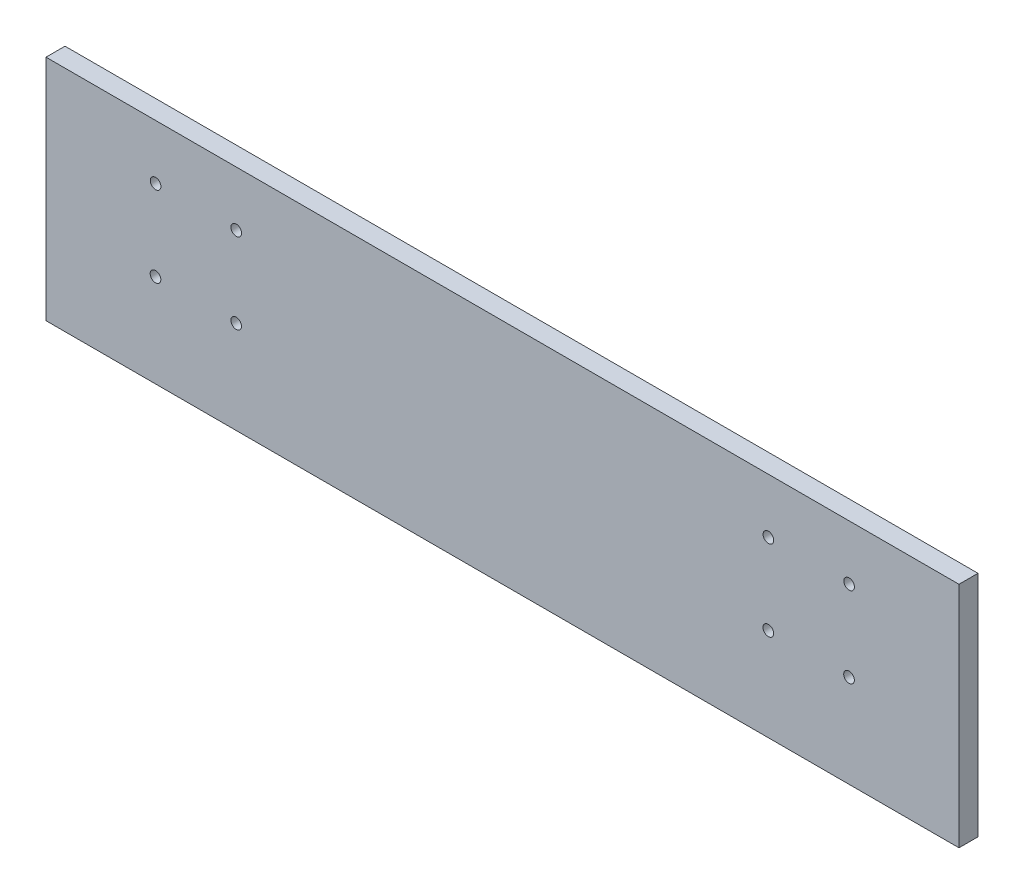
ISO-10303-21;
HEADER;
FILE_DESCRIPTION(('STEP AP214'),'2;1');
FILE_NAME('part.step','',(''),(''),'','','');
FILE_SCHEMA(('AUTOMOTIVE_DESIGN { 1 0 10303 214 1 1 1 1 }'));
ENDSEC;
DATA;
#1=APPLICATION_CONTEXT('core data for automotive mechanical design processes');
#2=APPLICATION_PROTOCOL_DEFINITION('international standard','automotive_design',2000,#1);
#3=PRODUCT_CONTEXT('',#1,'mechanical');
#4=PRODUCT('Part','Part','',(#3));
#5=PRODUCT_RELATED_PRODUCT_CATEGORY('part','',(#4));
#6=PRODUCT_DEFINITION_FORMATION('','',#4);
#7=PRODUCT_DEFINITION_CONTEXT('part definition',#1,'design');
#8=PRODUCT_DEFINITION('design','',#6,#7);
#9=PRODUCT_DEFINITION_SHAPE('','',#8);
#10=(LENGTH_UNIT() NAMED_UNIT(*) SI_UNIT(.MILLI.,.METRE.));
#11=(NAMED_UNIT(*) PLANE_ANGLE_UNIT() SI_UNIT($,.RADIAN.));
#12=(NAMED_UNIT(*) SI_UNIT($,.STERADIAN.) SOLID_ANGLE_UNIT());
#13=UNCERTAINTY_MEASURE_WITH_UNIT(LENGTH_MEASURE(1.E-05),#10,'distance_accuracy_value','');
#14=(GEOMETRIC_REPRESENTATION_CONTEXT(3) GLOBAL_UNCERTAINTY_ASSIGNED_CONTEXT((#13)) GLOBAL_UNIT_ASSIGNED_CONTEXT((#10,
#11,#12)) REPRESENTATION_CONTEXT('',''));
#15=CARTESIAN_POINT('',(0.,0.,0.));
#16=DIRECTION('',(0.,0.,1.));
#17=DIRECTION('',(1.,0.,0.));
#18=AXIS2_PLACEMENT_3D('',#15,#16,#17);
#19=CARTESIAN_POINT('',(0.,0.,6.35));
#20=DIRECTION('',(1.,0.,0.));
#21=DIRECTION('',(0.,0.,-1.));
#22=AXIS2_PLACEMENT_3D('',#19,#20,#21);
#23=PLANE('',#22);
#24=DIRECTION('',(0.,-1.,0.));
#25=VECTOR('',#24,1.);
#26=CARTESIAN_POINT('',(0.,0.,0.));
#27=LINE('',#26,#25);
#28=CARTESIAN_POINT('',(0.,76.2,0.));
#29=VERTEX_POINT('',#28);
#30=CARTESIAN_POINT('',(0.,0.,0.));
#31=VERTEX_POINT('',#30);
#32=EDGE_CURVE('E96',#29,#31,#27,.T.);
#33=ORIENTED_EDGE('',*,*,#32,.T.);
#34=DIRECTION('',(0.,0.,-1.));
#35=VECTOR('',#34,1.);
#36=CARTESIAN_POINT('',(0.,0.,6.35));
#37=LINE('',#36,#35);
#38=CARTESIAN_POINT('',(0.,0.,6.35));
#39=VERTEX_POINT('',#38);
#40=EDGE_CURVE('E11',#39,#31,#37,.T.);
#41=ORIENTED_EDGE('',*,*,#40,.F.);
#42=DIRECTION('',(0.,-1.,0.));
#43=VECTOR('',#42,1.);
#44=CARTESIAN_POINT('',(0.,0.,6.35));
#45=LINE('',#44,#43);
#46=CARTESIAN_POINT('',(0.,76.2,6.35));
#47=VERTEX_POINT('',#46);
#48=EDGE_CURVE('E84',#47,#39,#45,.T.);
#49=ORIENTED_EDGE('',*,*,#48,.F.);
#50=DIRECTION('',(0.,0.,-1.));
#51=VECTOR('',#50,1.);
#52=CARTESIAN_POINT('',(0.,76.2,6.35));
#53=LINE('',#52,#51);
#54=EDGE_CURVE('E92',#47,#29,#53,.T.);
#55=ORIENTED_EDGE('',*,*,#54,.T.);
#56=EDGE_LOOP('',(#33,#41,#49,#55));
#57=FACE_BOUND('',#56,.T.);
#58=ADVANCED_FACE('F33',(#57),#23,.F.);
#59=CARTESIAN_POINT('',(0.,0.,6.35));
#60=DIRECTION('',(0.,1.,0.));
#61=DIRECTION('',(0.,0.,1.));
#62=AXIS2_PLACEMENT_3D('',#59,#60,#61);
#63=PLANE('',#62);
#64=DIRECTION('',(1.,0.,0.));
#65=VECTOR('',#64,1.);
#66=CARTESIAN_POINT('',(0.,0.,0.));
#67=LINE('',#66,#65);
#68=CARTESIAN_POINT('',(304.8,0.,0.));
#69=VERTEX_POINT('',#68);
#70=EDGE_CURVE('E88',#31,#69,#67,.T.);
#71=ORIENTED_EDGE('',*,*,#70,.T.);
#72=DIRECTION('',(0.,0.,-1.));
#73=VECTOR('',#72,1.);
#74=CARTESIAN_POINT('',(304.8,0.,6.35));
#75=LINE('',#74,#73);
#76=CARTESIAN_POINT('',(304.8,0.,6.35));
#77=VERTEX_POINT('',#76);
#78=EDGE_CURVE('E41',#77,#69,#75,.T.);
#79=ORIENTED_EDGE('',*,*,#78,.F.);
#80=DIRECTION('',(1.,0.,0.));
#81=VECTOR('',#80,1.);
#82=CARTESIAN_POINT('',(0.,0.,6.35));
#83=LINE('',#82,#81);
#84=EDGE_CURVE('E79',#39,#77,#83,.T.);
#85=ORIENTED_EDGE('',*,*,#84,.F.);
#86=ORIENTED_EDGE('',*,*,#40,.T.);
#87=EDGE_LOOP('',(#71,#79,#85,#86));
#88=FACE_BOUND('',#87,.T.);
#89=ADVANCED_FACE('F87',(#88),#63,.F.);
#90=CARTESIAN_POINT('',(304.8,0.,6.35));
#91=DIRECTION('',(-1.,0.,0.));
#92=DIRECTION('',(0.,0.,1.));
#93=AXIS2_PLACEMENT_3D('',#90,#91,#92);
#94=PLANE('',#93);
#95=DIRECTION('',(0.,1.,0.));
#96=VECTOR('',#95,1.);
#97=CARTESIAN_POINT('',(304.8,0.,0.));
#98=LINE('',#97,#96);
#99=CARTESIAN_POINT('',(304.8,76.2,0.));
#100=VERTEX_POINT('',#99);
#101=EDGE_CURVE('E66',#69,#100,#98,.T.);
#102=ORIENTED_EDGE('',*,*,#101,.T.);
#103=DIRECTION('',(0.,0.,-1.));
#104=VECTOR('',#103,1.);
#105=CARTESIAN_POINT('',(304.8,76.2,6.35));
#106=LINE('',#105,#104);
#107=CARTESIAN_POINT('',(304.8,76.2,6.35));
#108=VERTEX_POINT('',#107);
#109=EDGE_CURVE('E89',#108,#100,#106,.T.);
#110=ORIENTED_EDGE('',*,*,#109,.F.);
#111=DIRECTION('',(0.,1.,0.));
#112=VECTOR('',#111,1.);
#113=CARTESIAN_POINT('',(304.8,0.,6.35));
#114=LINE('',#113,#112);
#115=EDGE_CURVE('E82',#77,#108,#114,.T.);
#116=ORIENTED_EDGE('',*,*,#115,.F.);
#117=ORIENTED_EDGE('',*,*,#78,.T.);
#118=EDGE_LOOP('',(#102,#110,#116,#117));
#119=FACE_BOUND('',#118,.T.);
#120=ADVANCED_FACE('F90',(#119),#94,.F.);
#121=CARTESIAN_POINT('',(0.,76.2,6.35));
#122=DIRECTION('',(0.,-1.,0.));
#123=DIRECTION('',(0.,0.,-1.));
#124=AXIS2_PLACEMENT_3D('',#121,#122,#123);
#125=PLANE('',#124);
#126=DIRECTION('',(-1.,0.,0.));
#127=VECTOR('',#126,1.);
#128=CARTESIAN_POINT('',(0.,76.2,0.));
#129=LINE('',#128,#127);
#130=EDGE_CURVE('E72',#100,#29,#129,.T.);
#131=ORIENTED_EDGE('',*,*,#130,.T.);
#132=ORIENTED_EDGE('',*,*,#54,.F.);
#133=DIRECTION('',(-1.,0.,0.));
#134=VECTOR('',#133,1.);
#135=CARTESIAN_POINT('',(0.,76.2,6.35));
#136=LINE('',#135,#134);
#137=EDGE_CURVE('E49',#108,#47,#136,.T.);
#138=ORIENTED_EDGE('',*,*,#137,.F.);
#139=ORIENTED_EDGE('',*,*,#109,.T.);
#140=EDGE_LOOP('',(#131,#132,#138,#139));
#141=FACE_BOUND('',#140,.T.);
#142=ADVANCED_FACE('F104',(#141),#125,.F.);
#143=CARTESIAN_POINT('',(0.,0.,6.35));
#144=DIRECTION('',(0.,0.,-1.));
#145=DIRECTION('',(-1.,0.,0.));
#146=AXIS2_PLACEMENT_3D('',#143,#144,#145);
#147=PLANE('',#146);
#148=CARTESIAN_POINT('',(36.5563858249365,31.0187951818948,6.35));
#149=DIRECTION('',(0.,0.,-1.));
#150=DIRECTION('',(-1.,0.,0.));
#151=AXIS2_PLACEMENT_3D('',#148,#149,#150);
#152=CIRCLE('',#151,1.77799999999999);
#153=CARTESIAN_POINT('',(34.7783858249365,31.0187951818948,6.35));
#154=VERTEX_POINT('',#153);
#155=EDGE_CURVE('E151',#154,#154,#152,.T.);
#156=ORIENTED_EDGE('',*,*,#155,.T.);
#157=EDGE_LOOP('',(#156));
#158=FACE_BOUND('',#157,.T.);
#159=CARTESIAN_POINT('',(63.4971448181051,30.9963258249363,6.35));
#160=DIRECTION('',(0.,0.,-1.));
#161=DIRECTION('',(-1.,0.,0.));
#162=AXIS2_PLACEMENT_3D('',#159,#160,#161);
#163=CIRCLE('',#162,1.778);
#164=CARTESIAN_POINT('',(61.7191448181051,30.9963258249363,6.35));
#165=VERTEX_POINT('',#164);
#166=EDGE_CURVE('E145',#165,#165,#163,.T.);
#167=ORIENTED_EDGE('',*,*,#166,.T.);
#168=EDGE_LOOP('',(#167));
#169=FACE_BOUND('',#168,.T.);
#170=CARTESIAN_POINT('',(63.5196141750636,57.937084818105,6.35));
#171=DIRECTION('',(0.,0.,-1.));
#172=DIRECTION('',(-1.,0.,0.));
#173=AXIS2_PLACEMENT_3D('',#170,#171,#172);
#174=CIRCLE('',#173,1.77799999999998);
#175=CARTESIAN_POINT('',(61.7416141750636,57.937084818105,6.35));
#176=VERTEX_POINT('',#175);
#177=EDGE_CURVE('E139',#176,#176,#174,.T.);
#178=ORIENTED_EDGE('',*,*,#177,.T.);
#179=EDGE_LOOP('',(#178));
#180=FACE_BOUND('',#179,.T.);
#181=CARTESIAN_POINT('',(36.5788551818951,57.9595541750636,6.35));
#182=DIRECTION('',(0.,0.,-1.));
#183=DIRECTION('',(-1.,0.,0.));
#184=AXIS2_PLACEMENT_3D('',#181,#182,#183);
#185=CIRCLE('',#184,1.77799999999999);
#186=CARTESIAN_POINT('',(34.8008551818951,57.9595541750636,6.35));
#187=VERTEX_POINT('',#186);
#188=EDGE_CURVE('E133',#187,#187,#185,.T.);
#189=ORIENTED_EDGE('',*,*,#188,.T.);
#190=EDGE_LOOP('',(#189));
#191=FACE_BOUND('',#190,.T.);
#192=CARTESIAN_POINT('',(268.094144818105,30.9963258249363,6.35));
#193=DIRECTION('',(0.,0.,-1.));
#194=DIRECTION('',(-1.,0.,0.));
#195=AXIS2_PLACEMENT_3D('',#192,#193,#194);
#196=CIRCLE('',#195,1.77800000000004);
#197=CARTESIAN_POINT('',(266.316144818105,30.9963258249363,6.35));
#198=VERTEX_POINT('',#197);
#199=EDGE_CURVE('E127',#198,#198,#196,.T.);
#200=ORIENTED_EDGE('',*,*,#199,.T.);
#201=EDGE_LOOP('',(#200));
#202=FACE_BOUND('',#201,.T.);
#203=CARTESIAN_POINT('',(241.153385824936,31.0187951818948,6.35));
#204=DIRECTION('',(0.,0.,-1.));
#205=DIRECTION('',(-1.,0.,0.));
#206=AXIS2_PLACEMENT_3D('',#203,#204,#205);
#207=CIRCLE('',#206,1.77800000000001);
#208=CARTESIAN_POINT('',(239.375385824936,31.0187951818948,6.35));
#209=VERTEX_POINT('',#208);
#210=EDGE_CURVE('E121',#209,#209,#207,.T.);
#211=ORIENTED_EDGE('',*,*,#210,.T.);
#212=EDGE_LOOP('',(#211));
#213=FACE_BOUND('',#212,.T.);
#214=CARTESIAN_POINT('',(241.175855181895,57.9595541750636,6.35));
#215=DIRECTION('',(0.,0.,-1.));
#216=DIRECTION('',(-1.,0.,0.));
#217=AXIS2_PLACEMENT_3D('',#214,#215,#216);
#218=CIRCLE('',#217,1.77800000000001);
#219=CARTESIAN_POINT('',(239.397855181895,57.9595541750636,6.35));
#220=VERTEX_POINT('',#219);
#221=EDGE_CURVE('E115',#220,#220,#218,.T.);
#222=ORIENTED_EDGE('',*,*,#221,.T.);
#223=EDGE_LOOP('',(#222));
#224=FACE_BOUND('',#223,.T.);
#225=CARTESIAN_POINT('',(268.116614175063,57.937084818105,6.35));
#226=DIRECTION('',(0.,0.,-1.));
#227=DIRECTION('',(-1.,0.,0.));
#228=AXIS2_PLACEMENT_3D('',#225,#226,#227);
#229=CIRCLE('',#228,1.77799999999998);
#230=CARTESIAN_POINT('',(266.338614175063,57.937084818105,6.35));
#231=VERTEX_POINT('',#230);
#232=EDGE_CURVE('E99',#231,#231,#229,.T.);
#233=ORIENTED_EDGE('',*,*,#232,.T.);
#234=EDGE_LOOP('',(#233));
#235=FACE_BOUND('',#234,.T.);
#236=ORIENTED_EDGE('',*,*,#48,.T.);
#237=ORIENTED_EDGE('',*,*,#84,.T.);
#238=ORIENTED_EDGE('',*,*,#115,.T.);
#239=ORIENTED_EDGE('',*,*,#137,.T.);
#240=EDGE_LOOP('',(#236,#237,#238,#239));
#241=FACE_BOUND('',#240,.T.);
#242=ADVANCED_FACE('F80',(#158,#169,#180,#191,#202,#213,#224,#235,#241),#147,.F.);
#243=CARTESIAN_POINT('',(0.,0.,0.));
#244=DIRECTION('',(0.,0.,-1.));
#245=DIRECTION('',(-1.,0.,0.));
#246=AXIS2_PLACEMENT_3D('',#243,#244,#245);
#247=PLANE('',#246);
#248=CARTESIAN_POINT('',(36.5563858249365,31.0187951818948,0.));
#249=DIRECTION('',(0.,0.,-1.));
#250=DIRECTION('',(-1.,0.,0.));
#251=AXIS2_PLACEMENT_3D('',#248,#249,#250);
#252=CIRCLE('',#251,1.77799999999999);
#253=CARTESIAN_POINT('',(34.7783858249365,31.0187951818948,0.));
#254=VERTEX_POINT('',#253);
#255=EDGE_CURVE('E154',#254,#254,#252,.T.);
#256=ORIENTED_EDGE('',*,*,#255,.F.);
#257=EDGE_LOOP('',(#256));
#258=FACE_BOUND('',#257,.T.);
#259=CARTESIAN_POINT('',(63.4971448181051,30.9963258249363,0.));
#260=DIRECTION('',(0.,0.,-1.));
#261=DIRECTION('',(-1.,0.,0.));
#262=AXIS2_PLACEMENT_3D('',#259,#260,#261);
#263=CIRCLE('',#262,1.778);
#264=CARTESIAN_POINT('',(61.7191448181051,30.9963258249363,0.));
#265=VERTEX_POINT('',#264);
#266=EDGE_CURVE('E148',#265,#265,#263,.T.);
#267=ORIENTED_EDGE('',*,*,#266,.F.);
#268=EDGE_LOOP('',(#267));
#269=FACE_BOUND('',#268,.T.);
#270=CARTESIAN_POINT('',(63.5196141750636,57.937084818105,0.));
#271=DIRECTION('',(0.,0.,-1.));
#272=DIRECTION('',(-1.,0.,0.));
#273=AXIS2_PLACEMENT_3D('',#270,#271,#272);
#274=CIRCLE('',#273,1.77799999999998);
#275=CARTESIAN_POINT('',(61.7416141750636,57.937084818105,0.));
#276=VERTEX_POINT('',#275);
#277=EDGE_CURVE('E142',#276,#276,#274,.T.);
#278=ORIENTED_EDGE('',*,*,#277,.F.);
#279=EDGE_LOOP('',(#278));
#280=FACE_BOUND('',#279,.T.);
#281=CARTESIAN_POINT('',(36.5788551818951,57.9595541750636,0.));
#282=DIRECTION('',(0.,0.,-1.));
#283=DIRECTION('',(-1.,0.,0.));
#284=AXIS2_PLACEMENT_3D('',#281,#282,#283);
#285=CIRCLE('',#284,1.77799999999999);
#286=CARTESIAN_POINT('',(34.8008551818951,57.9595541750636,0.));
#287=VERTEX_POINT('',#286);
#288=EDGE_CURVE('E136',#287,#287,#285,.T.);
#289=ORIENTED_EDGE('',*,*,#288,.F.);
#290=EDGE_LOOP('',(#289));
#291=FACE_BOUND('',#290,.T.);
#292=CARTESIAN_POINT('',(268.094144818105,30.9963258249363,0.));
#293=DIRECTION('',(0.,0.,-1.));
#294=DIRECTION('',(-1.,0.,0.));
#295=AXIS2_PLACEMENT_3D('',#292,#293,#294);
#296=CIRCLE('',#295,1.77800000000004);
#297=CARTESIAN_POINT('',(266.316144818105,30.9963258249363,0.));
#298=VERTEX_POINT('',#297);
#299=EDGE_CURVE('E130',#298,#298,#296,.T.);
#300=ORIENTED_EDGE('',*,*,#299,.F.);
#301=EDGE_LOOP('',(#300));
#302=FACE_BOUND('',#301,.T.);
#303=CARTESIAN_POINT('',(241.153385824936,31.0187951818948,0.));
#304=DIRECTION('',(0.,0.,-1.));
#305=DIRECTION('',(-1.,0.,0.));
#306=AXIS2_PLACEMENT_3D('',#303,#304,#305);
#307=CIRCLE('',#306,1.77800000000001);
#308=CARTESIAN_POINT('',(239.375385824936,31.0187951818948,0.));
#309=VERTEX_POINT('',#308);
#310=EDGE_CURVE('E124',#309,#309,#307,.T.);
#311=ORIENTED_EDGE('',*,*,#310,.F.);
#312=EDGE_LOOP('',(#311));
#313=FACE_BOUND('',#312,.T.);
#314=CARTESIAN_POINT('',(241.175855181895,57.9595541750636,0.));
#315=DIRECTION('',(0.,0.,-1.));
#316=DIRECTION('',(-1.,0.,0.));
#317=AXIS2_PLACEMENT_3D('',#314,#315,#316);
#318=CIRCLE('',#317,1.77800000000001);
#319=CARTESIAN_POINT('',(239.397855181895,57.9595541750636,0.));
#320=VERTEX_POINT('',#319);
#321=EDGE_CURVE('E118',#320,#320,#318,.T.);
#322=ORIENTED_EDGE('',*,*,#321,.F.);
#323=EDGE_LOOP('',(#322));
#324=FACE_BOUND('',#323,.T.);
#325=CARTESIAN_POINT('',(268.116614175063,57.937084818105,0.));
#326=DIRECTION('',(0.,0.,-1.));
#327=DIRECTION('',(-1.,0.,0.));
#328=AXIS2_PLACEMENT_3D('',#325,#326,#327);
#329=CIRCLE('',#328,1.77799999999998);
#330=CARTESIAN_POINT('',(266.338614175063,57.937084818105,0.));
#331=VERTEX_POINT('',#330);
#332=EDGE_CURVE('E112',#331,#331,#329,.T.);
#333=ORIENTED_EDGE('',*,*,#332,.F.);
#334=EDGE_LOOP('',(#333));
#335=FACE_BOUND('',#334,.T.);
#336=ORIENTED_EDGE('',*,*,#32,.F.);
#337=ORIENTED_EDGE('',*,*,#130,.F.);
#338=ORIENTED_EDGE('',*,*,#101,.F.);
#339=ORIENTED_EDGE('',*,*,#70,.F.);
#340=EDGE_LOOP('',(#336,#337,#338,#339));
#341=FACE_BOUND('',#340,.T.);
#342=ADVANCED_FACE('F107',(#258,#269,#280,#291,#302,#313,#324,#335,#341),#247,.T.);
#343=CARTESIAN_POINT('',(268.116614175063,57.937084818105,10.16));
#344=DIRECTION('',(0.,0.,-1.));
#345=DIRECTION('',(-1.,0.,0.));
#346=AXIS2_PLACEMENT_3D('',#343,#344,#345);
#347=CYLINDRICAL_SURFACE('',#346,1.77799999999998);
#348=ORIENTED_EDGE('',*,*,#332,.T.);
#349=EDGE_LOOP('',(#348));
#350=FACE_BOUND('',#349,.T.);
#351=ORIENTED_EDGE('',*,*,#232,.F.);
#352=EDGE_LOOP('',(#351));
#353=FACE_BOUND('',#352,.T.);
#354=ADVANCED_FACE('F163',(#350,#353),#347,.F.);
#355=CARTESIAN_POINT('',(241.175855181895,57.9595541750636,10.16));
#356=DIRECTION('',(0.,0.,-1.));
#357=DIRECTION('',(-1.,0.,0.));
#358=AXIS2_PLACEMENT_3D('',#355,#356,#357);
#359=CYLINDRICAL_SURFACE('',#358,1.77800000000001);
#360=ORIENTED_EDGE('',*,*,#321,.T.);
#361=EDGE_LOOP('',(#360));
#362=FACE_BOUND('',#361,.T.);
#363=ORIENTED_EDGE('',*,*,#221,.F.);
#364=EDGE_LOOP('',(#363));
#365=FACE_BOUND('',#364,.T.);
#366=ADVANCED_FACE('F181',(#362,#365),#359,.F.);
#367=CARTESIAN_POINT('',(241.153385824936,31.0187951818948,10.16));
#368=DIRECTION('',(0.,0.,-1.));
#369=DIRECTION('',(-1.,0.,0.));
#370=AXIS2_PLACEMENT_3D('',#367,#368,#369);
#371=CYLINDRICAL_SURFACE('',#370,1.77800000000001);
#372=ORIENTED_EDGE('',*,*,#310,.T.);
#373=EDGE_LOOP('',(#372));
#374=FACE_BOUND('',#373,.T.);
#375=ORIENTED_EDGE('',*,*,#210,.F.);
#376=EDGE_LOOP('',(#375));
#377=FACE_BOUND('',#376,.T.);
#378=ADVANCED_FACE('F227',(#374,#377),#371,.F.);
#379=CARTESIAN_POINT('',(268.094144818105,30.9963258249363,10.16));
#380=DIRECTION('',(0.,0.,-1.));
#381=DIRECTION('',(-1.,0.,0.));
#382=AXIS2_PLACEMENT_3D('',#379,#380,#381);
#383=CYLINDRICAL_SURFACE('',#382,1.77800000000004);
#384=ORIENTED_EDGE('',*,*,#299,.T.);
#385=EDGE_LOOP('',(#384));
#386=FACE_BOUND('',#385,.T.);
#387=ORIENTED_EDGE('',*,*,#199,.F.);
#388=EDGE_LOOP('',(#387));
#389=FACE_BOUND('',#388,.T.);
#390=ADVANCED_FACE('F235',(#386,#389),#383,.F.);
#391=CARTESIAN_POINT('',(36.5788551818951,57.9595541750636,10.16));
#392=DIRECTION('',(0.,0.,-1.));
#393=DIRECTION('',(-1.,0.,0.));
#394=AXIS2_PLACEMENT_3D('',#391,#392,#393);
#395=CYLINDRICAL_SURFACE('',#394,1.77799999999999);
#396=ORIENTED_EDGE('',*,*,#288,.T.);
#397=EDGE_LOOP('',(#396));
#398=FACE_BOUND('',#397,.T.);
#399=ORIENTED_EDGE('',*,*,#188,.F.);
#400=EDGE_LOOP('',(#399));
#401=FACE_BOUND('',#400,.T.);
#402=ADVANCED_FACE('F243',(#398,#401),#395,.F.);
#403=CARTESIAN_POINT('',(63.5196141750636,57.937084818105,10.16));
#404=DIRECTION('',(0.,0.,-1.));
#405=DIRECTION('',(-1.,0.,0.));
#406=AXIS2_PLACEMENT_3D('',#403,#404,#405);
#407=CYLINDRICAL_SURFACE('',#406,1.77799999999998);
#408=ORIENTED_EDGE('',*,*,#277,.T.);
#409=EDGE_LOOP('',(#408));
#410=FACE_BOUND('',#409,.T.);
#411=ORIENTED_EDGE('',*,*,#177,.F.);
#412=EDGE_LOOP('',(#411));
#413=FACE_BOUND('',#412,.T.);
#414=ADVANCED_FACE('F251',(#410,#413),#407,.F.);
#415=CARTESIAN_POINT('',(63.4971448181051,30.9963258249363,10.16));
#416=DIRECTION('',(0.,0.,-1.));
#417=DIRECTION('',(-1.,0.,0.));
#418=AXIS2_PLACEMENT_3D('',#415,#416,#417);
#419=CYLINDRICAL_SURFACE('',#418,1.778);
#420=ORIENTED_EDGE('',*,*,#266,.T.);
#421=EDGE_LOOP('',(#420));
#422=FACE_BOUND('',#421,.T.);
#423=ORIENTED_EDGE('',*,*,#166,.F.);
#424=EDGE_LOOP('',(#423));
#425=FACE_BOUND('',#424,.T.);
#426=ADVANCED_FACE('F259',(#422,#425),#419,.F.);
#427=CARTESIAN_POINT('',(36.5563858249365,31.0187951818948,10.16));
#428=DIRECTION('',(0.,0.,-1.));
#429=DIRECTION('',(-1.,0.,0.));
#430=AXIS2_PLACEMENT_3D('',#427,#428,#429);
#431=CYLINDRICAL_SURFACE('',#430,1.77799999999999);
#432=ORIENTED_EDGE('',*,*,#255,.T.);
#433=EDGE_LOOP('',(#432));
#434=FACE_BOUND('',#433,.T.);
#435=ORIENTED_EDGE('',*,*,#155,.F.);
#436=EDGE_LOOP('',(#435));
#437=FACE_BOUND('',#436,.T.);
#438=ADVANCED_FACE('F158',(#434,#437),#431,.F.);
#439=CLOSED_SHELL('',(#58,#89,#120,#142,#242,#342,#354,#366,#378,#390,#402,#414,#426,#438));
#440=MANIFOLD_SOLID_BREP('B2',#439);
#441=ADVANCED_BREP_SHAPE_REPRESENTATION('',(#18,#440),#14);
#442=SHAPE_DEFINITION_REPRESENTATION(#9,#441);
ENDSEC;
END-ISO-10303-21;
